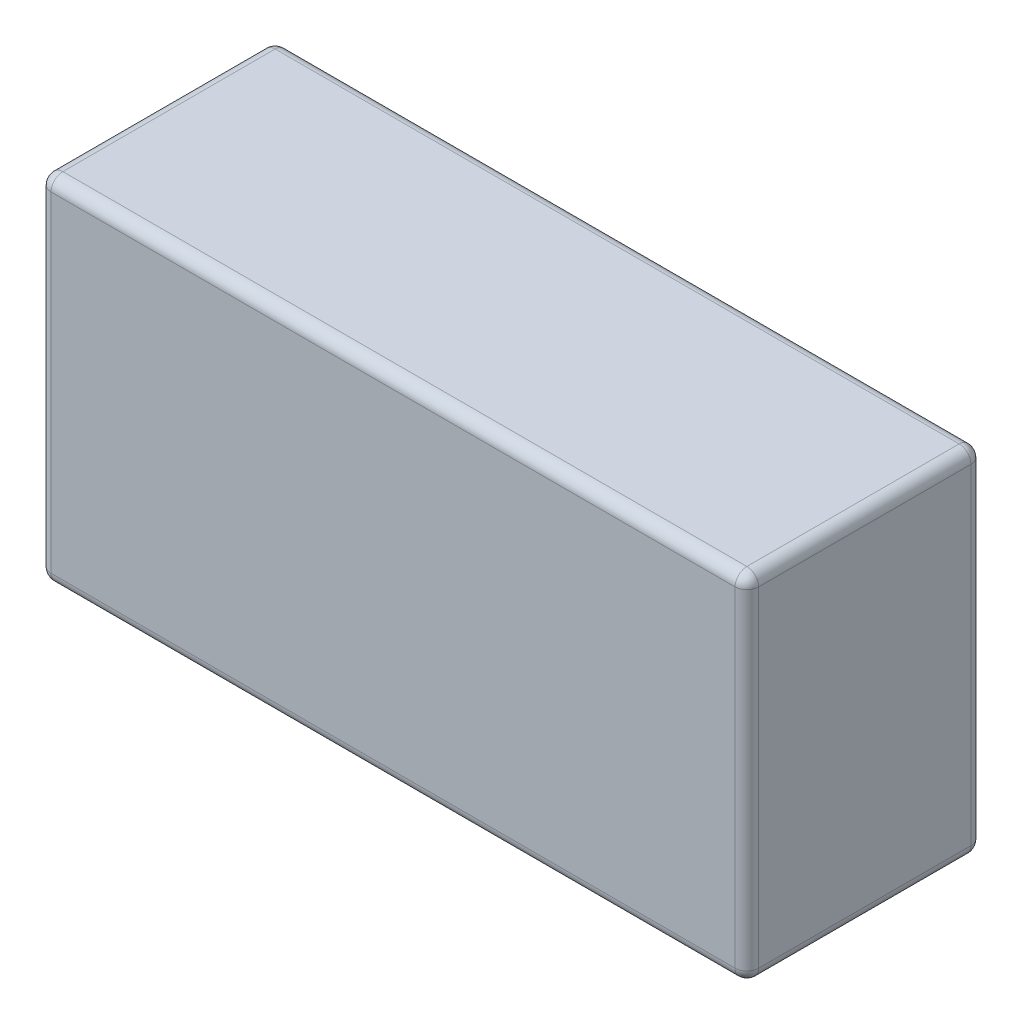
ISO-10303-21;
HEADER;
FILE_DESCRIPTION(('STEP AP214'),'2;1');
FILE_NAME('part.step','',(''),(''),'','','');
FILE_SCHEMA(('AUTOMOTIVE_DESIGN { 1 0 10303 214 1 1 1 1 }'));
ENDSEC;
DATA;
#1=APPLICATION_CONTEXT('core data for automotive mechanical design processes');
#2=APPLICATION_PROTOCOL_DEFINITION('international standard','automotive_design',2000,#1);
#3=PRODUCT_CONTEXT('',#1,'mechanical');
#4=PRODUCT('Part','Part','',(#3));
#5=PRODUCT_RELATED_PRODUCT_CATEGORY('part','',(#4));
#6=PRODUCT_DEFINITION_FORMATION('','',#4);
#7=PRODUCT_DEFINITION_CONTEXT('part definition',#1,'design');
#8=PRODUCT_DEFINITION('design','',#6,#7);
#9=PRODUCT_DEFINITION_SHAPE('','',#8);
#10=(LENGTH_UNIT() NAMED_UNIT(*) SI_UNIT(.MILLI.,.METRE.));
#11=(NAMED_UNIT(*) PLANE_ANGLE_UNIT() SI_UNIT($,.RADIAN.));
#12=(NAMED_UNIT(*) SI_UNIT($,.STERADIAN.) SOLID_ANGLE_UNIT());
#13=UNCERTAINTY_MEASURE_WITH_UNIT(LENGTH_MEASURE(1.E-05),#10,'distance_accuracy_value','');
#14=(GEOMETRIC_REPRESENTATION_CONTEXT(3) GLOBAL_UNCERTAINTY_ASSIGNED_CONTEXT((#13)) GLOBAL_UNIT_ASSIGNED_CONTEXT((#10,
#11,#12)) REPRESENTATION_CONTEXT('',''));
#15=CARTESIAN_POINT('',(0.,0.,0.));
#16=DIRECTION('',(0.,0.,1.));
#17=DIRECTION('',(1.,0.,0.));
#18=AXIS2_PLACEMENT_3D('',#15,#16,#17);
#19=CARTESIAN_POINT('',(30.,15.,20.));
#20=DIRECTION('',(-1.,0.,0.));
#21=DIRECTION('',(0.,-1.,0.));
#22=AXIS2_PLACEMENT_3D('',#19,#20,#21);
#23=PLANE('',#22);
#24=DIRECTION('',(0.,1.,0.));
#25=VECTOR('',#24,1.);
#26=CARTESIAN_POINT('',(30.,-15.,19.));
#27=LINE('',#26,#25);
#28=CARTESIAN_POINT('',(30.,14.,19.));
#29=VERTEX_POINT('',#28);
#30=CARTESIAN_POINT('',(30.,-14.,19.));
#31=VERTEX_POINT('',#30);
#32=EDGE_CURVE('E222',#29,#31,#27,.F.);
#33=ORIENTED_EDGE('',*,*,#32,.T.);
#34=DIRECTION('',(0.,0.,-1.));
#35=VECTOR('',#34,1.);
#36=CARTESIAN_POINT('',(30.,-14.,20.));
#37=LINE('',#36,#35);
#38=CARTESIAN_POINT('',(30.,-14.,1.));
#39=VERTEX_POINT('',#38);
#40=EDGE_CURVE('E226',#31,#39,#37,.T.);
#41=ORIENTED_EDGE('',*,*,#40,.T.);
#42=DIRECTION('',(0.,1.,0.));
#43=VECTOR('',#42,1.);
#44=CARTESIAN_POINT('',(30.,15.,1.));
#45=LINE('',#44,#43);
#46=CARTESIAN_POINT('',(30.,14.,1.));
#47=VERTEX_POINT('',#46);
#48=EDGE_CURVE('E219',#39,#47,#45,.T.);
#49=ORIENTED_EDGE('',*,*,#48,.T.);
#50=DIRECTION('',(0.,0.,-1.));
#51=VECTOR('',#50,1.);
#52=CARTESIAN_POINT('',(30.,14.,20.));
#53=LINE('',#52,#51);
#54=EDGE_CURVE('E216',#47,#29,#53,.F.);
#55=ORIENTED_EDGE('',*,*,#54,.T.);
#56=EDGE_LOOP('',(#33,#41,#49,#55));
#57=FACE_BOUND('',#56,.T.);
#58=ADVANCED_FACE('F43',(#57),#23,.F.);
#59=CARTESIAN_POINT('',(-30.,15.,20.));
#60=DIRECTION('',(0.,-1.,0.));
#61=DIRECTION('',(0.,0.,-1.));
#62=AXIS2_PLACEMENT_3D('',#59,#60,#61);
#63=PLANE('',#62);
#64=DIRECTION('',(-1.,0.,0.));
#65=VECTOR('',#64,1.);
#66=CARTESIAN_POINT('',(-30.,15.,1.));
#67=LINE('',#66,#65);
#68=CARTESIAN_POINT('',(29.,15.,1.));
#69=VERTEX_POINT('',#68);
#70=CARTESIAN_POINT('',(-29.,15.,1.));
#71=VERTEX_POINT('',#70);
#72=EDGE_CURVE('E53',#69,#71,#67,.T.);
#73=ORIENTED_EDGE('',*,*,#72,.T.);
#74=DIRECTION('',(0.,0.,-1.));
#75=VECTOR('',#74,1.);
#76=CARTESIAN_POINT('',(-29.,15.,20.));
#77=LINE('',#76,#75);
#78=CARTESIAN_POINT('',(-29.,15.,19.));
#79=VERTEX_POINT('',#78);
#80=EDGE_CURVE('E11',#71,#79,#77,.F.);
#81=ORIENTED_EDGE('',*,*,#80,.T.);
#82=DIRECTION('',(-1.,0.,0.));
#83=VECTOR('',#82,1.);
#84=CARTESIAN_POINT('',(30.,15.,19.));
#85=LINE('',#84,#83);
#86=CARTESIAN_POINT('',(29.,15.,19.));
#87=VERTEX_POINT('',#86);
#88=EDGE_CURVE('E232',#79,#87,#85,.F.);
#89=ORIENTED_EDGE('',*,*,#88,.T.);
#90=DIRECTION('',(0.,0.,-1.));
#91=VECTOR('',#90,1.);
#92=CARTESIAN_POINT('',(29.,15.,20.));
#93=LINE('',#92,#91);
#94=EDGE_CURVE('E229',#87,#69,#93,.T.);
#95=ORIENTED_EDGE('',*,*,#94,.T.);
#96=EDGE_LOOP('',(#73,#81,#89,#95));
#97=FACE_BOUND('',#96,.T.);
#98=ADVANCED_FACE('F353',(#97),#63,.F.);
#99=CARTESIAN_POINT('',(-30.,15.,20.));
#100=DIRECTION('',(1.,0.,0.));
#101=DIRECTION('',(0.,1.,0.));
#102=AXIS2_PLACEMENT_3D('',#99,#100,#101);
#103=PLANE('',#102);
#104=DIRECTION('',(0.,0.,-1.));
#105=VECTOR('',#104,1.);
#106=CARTESIAN_POINT('',(-30.,14.,20.));
#107=LINE('',#106,#105);
#108=CARTESIAN_POINT('',(-30.,14.,19.));
#109=VERTEX_POINT('',#108);
#110=CARTESIAN_POINT('',(-30.,14.,1.));
#111=VERTEX_POINT('',#110);
#112=EDGE_CURVE('E190',#109,#111,#107,.T.);
#113=ORIENTED_EDGE('',*,*,#112,.T.);
#114=DIRECTION('',(0.,-1.,0.));
#115=VECTOR('',#114,1.);
#116=CARTESIAN_POINT('',(-30.,15.,1.));
#117=LINE('',#116,#115);
#118=CARTESIAN_POINT('',(-30.,-14.,1.));
#119=VERTEX_POINT('',#118);
#120=EDGE_CURVE('E199',#111,#119,#117,.T.);
#121=ORIENTED_EDGE('',*,*,#120,.T.);
#122=DIRECTION('',(0.,0.,-1.));
#123=VECTOR('',#122,1.);
#124=CARTESIAN_POINT('',(-30.,-14.,20.));
#125=LINE('',#124,#123);
#126=CARTESIAN_POINT('',(-30.,-14.,19.));
#127=VERTEX_POINT('',#126);
#128=EDGE_CURVE('E196',#119,#127,#125,.F.);
#129=ORIENTED_EDGE('',*,*,#128,.T.);
#130=DIRECTION('',(0.,-1.,0.));
#131=VECTOR('',#130,1.);
#132=CARTESIAN_POINT('',(-30.,15.,19.));
#133=LINE('',#132,#131);
#134=EDGE_CURVE('E193',#127,#109,#133,.F.);
#135=ORIENTED_EDGE('',*,*,#134,.T.);
#136=EDGE_LOOP('',(#113,#121,#129,#135));
#137=FACE_BOUND('',#136,.T.);
#138=ADVANCED_FACE('F325',(#137),#103,.F.);
#139=CARTESIAN_POINT('',(-30.,-15.,20.));
#140=DIRECTION('',(0.,1.,0.));
#141=DIRECTION('',(0.,0.,1.));
#142=AXIS2_PLACEMENT_3D('',#139,#140,#141);
#143=PLANE('',#142);
#144=DIRECTION('',(0.,0.,-1.));
#145=VECTOR('',#144,1.);
#146=CARTESIAN_POINT('',(-29.,-15.,20.));
#147=LINE('',#146,#145);
#148=CARTESIAN_POINT('',(-29.,-15.,19.));
#149=VERTEX_POINT('',#148);
#150=CARTESIAN_POINT('',(-29.,-15.,1.));
#151=VERTEX_POINT('',#150);
#152=EDGE_CURVE('E171',#149,#151,#147,.T.);
#153=ORIENTED_EDGE('',*,*,#152,.T.);
#154=DIRECTION('',(1.,0.,0.));
#155=VECTOR('',#154,1.);
#156=CARTESIAN_POINT('',(-30.,-15.,1.));
#157=LINE('',#156,#155);
#158=CARTESIAN_POINT('',(29.,-15.,1.));
#159=VERTEX_POINT('',#158);
#160=EDGE_CURVE('E141',#151,#159,#157,.T.);
#161=ORIENTED_EDGE('',*,*,#160,.T.);
#162=DIRECTION('',(0.,0.,-1.));
#163=VECTOR('',#162,1.);
#164=CARTESIAN_POINT('',(29.,-15.,20.));
#165=LINE('',#164,#163);
#166=CARTESIAN_POINT('',(29.,-15.,19.));
#167=VERTEX_POINT('',#166);
#168=EDGE_CURVE('E160',#159,#167,#165,.F.);
#169=ORIENTED_EDGE('',*,*,#168,.T.);
#170=DIRECTION('',(1.,0.,0.));
#171=VECTOR('',#170,1.);
#172=CARTESIAN_POINT('',(-30.,-15.,19.));
#173=LINE('',#172,#171);
#174=EDGE_CURVE('E167',#167,#149,#173,.F.);
#175=ORIENTED_EDGE('',*,*,#174,.T.);
#176=EDGE_LOOP('',(#153,#161,#169,#175));
#177=FACE_BOUND('',#176,.T.);
#178=ADVANCED_FACE('F169',(#177),#143,.F.);
#179=CARTESIAN_POINT('',(0.,0.,20.));
#180=DIRECTION('',(0.,0.,1.));
#181=DIRECTION('',(1.,0.,0.));
#182=AXIS2_PLACEMENT_3D('',#179,#180,#181);
#183=PLANE('',#182);
#184=DIRECTION('',(0.,-1.,0.));
#185=VECTOR('',#184,1.);
#186=CARTESIAN_POINT('',(-29.,-15.,20.));
#187=LINE('',#186,#185);
#188=CARTESIAN_POINT('',(-29.,14.,20.));
#189=VERTEX_POINT('',#188);
#190=CARTESIAN_POINT('',(-29.,-14.,20.));
#191=VERTEX_POINT('',#190);
#192=EDGE_CURVE('E206',#189,#191,#187,.T.);
#193=ORIENTED_EDGE('',*,*,#192,.T.);
#194=DIRECTION('',(1.,0.,0.));
#195=VECTOR('',#194,1.);
#196=CARTESIAN_POINT('',(30.,-14.,20.));
#197=LINE('',#196,#195);
#198=CARTESIAN_POINT('',(29.,-14.,20.));
#199=VERTEX_POINT('',#198);
#200=EDGE_CURVE('E212',#191,#199,#197,.T.);
#201=ORIENTED_EDGE('',*,*,#200,.T.);
#202=DIRECTION('',(0.,1.,0.));
#203=VECTOR('',#202,1.);
#204=CARTESIAN_POINT('',(29.,15.,20.));
#205=LINE('',#204,#203);
#206=CARTESIAN_POINT('',(29.,14.,20.));
#207=VERTEX_POINT('',#206);
#208=EDGE_CURVE('E209',#199,#207,#205,.T.);
#209=ORIENTED_EDGE('',*,*,#208,.T.);
#210=DIRECTION('',(-1.,0.,0.));
#211=VECTOR('',#210,1.);
#212=CARTESIAN_POINT('',(-30.,14.,20.));
#213=LINE('',#212,#211);
#214=EDGE_CURVE('E203',#207,#189,#213,.T.);
#215=ORIENTED_EDGE('',*,*,#214,.T.);
#216=EDGE_LOOP('',(#193,#201,#209,#215));
#217=FACE_BOUND('',#216,.T.);
#218=ADVANCED_FACE('F334',(#217),#183,.T.);
#219=CARTESIAN_POINT('',(0.,0.,0.));
#220=DIRECTION('',(0.,0.,1.));
#221=DIRECTION('',(1.,0.,0.));
#222=AXIS2_PLACEMENT_3D('',#219,#220,#221);
#223=PLANE('',#222);
#224=DIRECTION('',(0.,1.,0.));
#225=VECTOR('',#224,1.);
#226=CARTESIAN_POINT('',(29.,0.,0.));
#227=LINE('',#226,#225);
#228=CARTESIAN_POINT('',(29.,14.,0.));
#229=VERTEX_POINT('',#228);
#230=CARTESIAN_POINT('',(29.,-14.,0.));
#231=VERTEX_POINT('',#230);
#232=EDGE_CURVE('E178',#229,#231,#227,.F.);
#233=ORIENTED_EDGE('',*,*,#232,.T.);
#234=DIRECTION('',(1.,0.,0.));
#235=VECTOR('',#234,1.);
#236=CARTESIAN_POINT('',(0.,-14.,0.));
#237=LINE('',#236,#235);
#238=CARTESIAN_POINT('',(-29.,-14.,0.));
#239=VERTEX_POINT('',#238);
#240=EDGE_CURVE('E143',#231,#239,#237,.F.);
#241=ORIENTED_EDGE('',*,*,#240,.T.);
#242=DIRECTION('',(0.,-1.,0.));
#243=VECTOR('',#242,1.);
#244=CARTESIAN_POINT('',(-29.,0.,0.));
#245=LINE('',#244,#243);
#246=CARTESIAN_POINT('',(-29.,14.,0.));
#247=VERTEX_POINT('',#246);
#248=EDGE_CURVE('E185',#239,#247,#245,.F.);
#249=ORIENTED_EDGE('',*,*,#248,.T.);
#250=DIRECTION('',(-1.,0.,0.));
#251=VECTOR('',#250,1.);
#252=CARTESIAN_POINT('',(0.,14.,0.));
#253=LINE('',#252,#251);
#254=EDGE_CURVE('E174',#247,#229,#253,.F.);
#255=ORIENTED_EDGE('',*,*,#254,.T.);
#256=EDGE_LOOP('',(#233,#241,#249,#255));
#257=FACE_BOUND('',#256,.T.);
#258=ADVANCED_FACE('F413',(#257),#223,.F.);
#259=CARTESIAN_POINT('',(0.,14.,19.));
#260=DIRECTION('',(1.,0.,0.));
#261=DIRECTION('',(0.,0.,-1.));
#262=AXIS2_PLACEMENT_3D('',#259,#260,#261);
#263=CYLINDRICAL_SURFACE('',#262,1.);
#264=CARTESIAN_POINT('',(-29.,14.,19.));
#265=DIRECTION('',(-1.,0.,0.));
#266=DIRECTION('',(0.,0.,1.));
#267=AXIS2_PLACEMENT_3D('',#264,#265,#266);
#268=CIRCLE('',#267,1.);
#269=EDGE_CURVE('E47',#189,#79,#268,.T.);
#270=ORIENTED_EDGE('',*,*,#269,.F.);
#271=ORIENTED_EDGE('',*,*,#214,.F.);
#272=CARTESIAN_POINT('',(29.,14.,19.));
#273=DIRECTION('',(1.,0.,0.));
#274=DIRECTION('',(0.,0.,-1.));
#275=AXIS2_PLACEMENT_3D('',#272,#273,#274);
#276=CIRCLE('',#275,1.);
#277=EDGE_CURVE('E304',#87,#207,#276,.T.);
#278=ORIENTED_EDGE('',*,*,#277,.F.);
#279=ORIENTED_EDGE('',*,*,#88,.F.);
#280=EDGE_LOOP('',(#270,#271,#278,#279));
#281=FACE_BOUND('',#280,.T.);
#282=ADVANCED_FACE('F45',(#281),#263,.T.);
#283=CARTESIAN_POINT('',(-29.,14.,19.));
#284=DIRECTION('',(0.,1.,0.));
#285=DIRECTION('',(0.,0.,1.));
#286=AXIS2_PLACEMENT_3D('',#283,#284,#285);
#287=SPHERICAL_SURFACE('',#286,1.);
#288=CARTESIAN_POINT('',(-29.,14.,19.));
#289=DIRECTION('',(0.,1.,0.));
#290=DIRECTION('',(0.,0.,1.));
#291=AXIS2_PLACEMENT_3D('',#288,#289,#290);
#292=CIRCLE('',#291,1.);
#293=EDGE_CURVE('E297',#189,#109,#292,.F.);
#294=ORIENTED_EDGE('',*,*,#293,.F.);
#295=ORIENTED_EDGE('',*,*,#269,.T.);
#296=CARTESIAN_POINT('',(-29.,14.,19.));
#297=DIRECTION('',(0.,0.,1.));
#298=DIRECTION('',(1.,0.,0.));
#299=AXIS2_PLACEMENT_3D('',#296,#297,#298);
#300=CIRCLE('',#299,1.);
#301=EDGE_CURVE('E301',#109,#79,#300,.F.);
#302=ORIENTED_EDGE('',*,*,#301,.F.);
#303=EDGE_LOOP('',(#294,#295,#302));
#304=FACE_BOUND('',#303,.T.);
#305=ADVANCED_FACE('F317',(#304),#287,.T.);
#306=CARTESIAN_POINT('',(29.,14.,19.));
#307=DIRECTION('',(0.,0.,1.));
#308=DIRECTION('',(1.,0.,0.));
#309=AXIS2_PLACEMENT_3D('',#306,#307,#308);
#310=SPHERICAL_SURFACE('',#309,1.);
#311=CARTESIAN_POINT('',(29.,14.,19.));
#312=DIRECTION('',(0.,0.,1.));
#313=DIRECTION('',(1.,0.,0.));
#314=AXIS2_PLACEMENT_3D('',#311,#312,#313);
#315=CIRCLE('',#314,1.);
#316=EDGE_CURVE('E289',#87,#29,#315,.F.);
#317=ORIENTED_EDGE('',*,*,#316,.F.);
#318=ORIENTED_EDGE('',*,*,#277,.T.);
#319=CARTESIAN_POINT('',(29.,14.,19.));
#320=DIRECTION('',(0.,1.,0.));
#321=DIRECTION('',(0.,0.,1.));
#322=AXIS2_PLACEMENT_3D('',#319,#320,#321);
#323=CIRCLE('',#322,1.);
#324=EDGE_CURVE('E293',#29,#207,#323,.F.);
#325=ORIENTED_EDGE('',*,*,#324,.F.);
#326=EDGE_LOOP('',(#317,#318,#325));
#327=FACE_BOUND('',#326,.T.);
#328=ADVANCED_FACE('F347',(#327),#310,.T.);
#329=CARTESIAN_POINT('',(-29.,14.,20.));
#330=DIRECTION('',(0.,0.,-1.));
#331=DIRECTION('',(-1.,0.,0.));
#332=AXIS2_PLACEMENT_3D('',#329,#330,#331);
#333=CYLINDRICAL_SURFACE('',#332,1.);
#334=ORIENTED_EDGE('',*,*,#301,.T.);
#335=ORIENTED_EDGE('',*,*,#80,.F.);
#336=CARTESIAN_POINT('',(-29.,14.,1.));
#337=DIRECTION('',(0.,0.,-1.));
#338=DIRECTION('',(-1.,0.,0.));
#339=AXIS2_PLACEMENT_3D('',#336,#337,#338);
#340=CIRCLE('',#339,1.);
#341=EDGE_CURVE('E61',#111,#71,#340,.T.);
#342=ORIENTED_EDGE('',*,*,#341,.F.);
#343=ORIENTED_EDGE('',*,*,#112,.F.);
#344=EDGE_LOOP('',(#334,#335,#342,#343));
#345=FACE_BOUND('',#344,.T.);
#346=ADVANCED_FACE('F323',(#345),#333,.T.);
#347=CARTESIAN_POINT('',(-29.,0.,19.));
#348=DIRECTION('',(0.,1.,0.));
#349=DIRECTION('',(-1.,0.,0.));
#350=AXIS2_PLACEMENT_3D('',#347,#348,#349);
#351=CYLINDRICAL_SURFACE('',#350,1.);
#352=ORIENTED_EDGE('',*,*,#293,.T.);
#353=ORIENTED_EDGE('',*,*,#134,.F.);
#354=CARTESIAN_POINT('',(-29.,-14.,19.));
#355=DIRECTION('',(0.,-1.,0.));
#356=DIRECTION('',(0.,0.,-1.));
#357=AXIS2_PLACEMENT_3D('',#354,#355,#356);
#358=CIRCLE('',#357,1.);
#359=EDGE_CURVE('E280',#191,#127,#358,.T.);
#360=ORIENTED_EDGE('',*,*,#359,.F.);
#361=ORIENTED_EDGE('',*,*,#192,.F.);
#362=EDGE_LOOP('',(#352,#353,#360,#361));
#363=FACE_BOUND('',#362,.T.);
#364=ADVANCED_FACE('F331',(#363),#351,.T.);
#365=CARTESIAN_POINT('',(0.,-14.,19.));
#366=DIRECTION('',(-1.,0.,0.));
#367=DIRECTION('',(0.,0.,1.));
#368=AXIS2_PLACEMENT_3D('',#365,#366,#367);
#369=CYLINDRICAL_SURFACE('',#368,1.);
#370=CARTESIAN_POINT('',(29.,-14.,19.));
#371=DIRECTION('',(1.,0.,0.));
#372=DIRECTION('',(0.,0.,-1.));
#373=AXIS2_PLACEMENT_3D('',#370,#371,#372);
#374=CIRCLE('',#373,1.);
#375=EDGE_CURVE('E272',#199,#167,#374,.T.);
#376=ORIENTED_EDGE('',*,*,#375,.F.);
#377=ORIENTED_EDGE('',*,*,#200,.F.);
#378=CARTESIAN_POINT('',(-29.,-14.,19.));
#379=DIRECTION('',(-1.,0.,0.));
#380=DIRECTION('',(0.,0.,1.));
#381=AXIS2_PLACEMENT_3D('',#378,#379,#380);
#382=CIRCLE('',#381,1.);
#383=EDGE_CURVE('E276',#149,#191,#382,.T.);
#384=ORIENTED_EDGE('',*,*,#383,.F.);
#385=ORIENTED_EDGE('',*,*,#174,.F.);
#386=EDGE_LOOP('',(#376,#377,#384,#385));
#387=FACE_BOUND('',#386,.T.);
#388=ADVANCED_FACE('F338',(#387),#369,.T.);
#389=CARTESIAN_POINT('',(29.,0.,19.));
#390=DIRECTION('',(0.,-1.,0.));
#391=DIRECTION('',(1.,0.,0.));
#392=AXIS2_PLACEMENT_3D('',#389,#390,#391);
#393=CYLINDRICAL_SURFACE('',#392,1.);
#394=ORIENTED_EDGE('',*,*,#324,.T.);
#395=ORIENTED_EDGE('',*,*,#208,.F.);
#396=CARTESIAN_POINT('',(29.,-14.,19.));
#397=DIRECTION('',(0.,-1.,0.));
#398=DIRECTION('',(0.,0.,-1.));
#399=AXIS2_PLACEMENT_3D('',#396,#397,#398);
#400=CIRCLE('',#399,1.);
#401=EDGE_CURVE('E269',#31,#199,#400,.T.);
#402=ORIENTED_EDGE('',*,*,#401,.F.);
#403=ORIENTED_EDGE('',*,*,#32,.F.);
#404=EDGE_LOOP('',(#394,#395,#402,#403));
#405=FACE_BOUND('',#404,.T.);
#406=ADVANCED_FACE('F344',(#405),#393,.T.);
#407=CARTESIAN_POINT('',(29.,14.,20.));
#408=DIRECTION('',(0.,0.,-1.));
#409=DIRECTION('',(-1.,0.,0.));
#410=AXIS2_PLACEMENT_3D('',#407,#408,#409);
#411=CYLINDRICAL_SURFACE('',#410,1.);
#412=ORIENTED_EDGE('',*,*,#316,.T.);
#413=ORIENTED_EDGE('',*,*,#54,.F.);
#414=CARTESIAN_POINT('',(29.,14.,1.));
#415=DIRECTION('',(0.,0.,-1.));
#416=DIRECTION('',(-1.,0.,0.));
#417=AXIS2_PLACEMENT_3D('',#414,#415,#416);
#418=CIRCLE('',#417,1.);
#419=EDGE_CURVE('E265',#69,#47,#418,.T.);
#420=ORIENTED_EDGE('',*,*,#419,.F.);
#421=ORIENTED_EDGE('',*,*,#94,.F.);
#422=EDGE_LOOP('',(#412,#413,#420,#421));
#423=FACE_BOUND('',#422,.T.);
#424=ADVANCED_FACE('F351',(#423),#411,.T.);
#425=CARTESIAN_POINT('',(-30.,14.,1.));
#426=DIRECTION('',(-1.,0.,0.));
#427=DIRECTION('',(0.,0.,1.));
#428=AXIS2_PLACEMENT_3D('',#425,#426,#427);
#429=CYLINDRICAL_SURFACE('',#428,1.);
#430=CARTESIAN_POINT('',(-29.,14.,1.));
#431=DIRECTION('',(-1.,0.,0.));
#432=DIRECTION('',(0.,0.,1.));
#433=AXIS2_PLACEMENT_3D('',#430,#431,#432);
#434=CIRCLE('',#433,1.);
#435=EDGE_CURVE('E286',#71,#247,#434,.T.);
#436=ORIENTED_EDGE('',*,*,#435,.F.);
#437=ORIENTED_EDGE('',*,*,#72,.F.);
#438=CARTESIAN_POINT('',(29.,14.,1.));
#439=DIRECTION('',(1.,0.,0.));
#440=DIRECTION('',(0.,0.,-1.));
#441=AXIS2_PLACEMENT_3D('',#438,#439,#440);
#442=CIRCLE('',#441,1.);
#443=EDGE_CURVE('E261',#229,#69,#442,.T.);
#444=ORIENTED_EDGE('',*,*,#443,.F.);
#445=ORIENTED_EDGE('',*,*,#254,.F.);
#446=EDGE_LOOP('',(#436,#437,#444,#445));
#447=FACE_BOUND('',#446,.T.);
#448=ADVANCED_FACE('F356',(#447),#429,.T.);
#449=CARTESIAN_POINT('',(-29.,14.,1.));
#450=DIRECTION('',(0.,1.,0.));
#451=DIRECTION('',(0.,0.,1.));
#452=AXIS2_PLACEMENT_3D('',#449,#450,#451);
#453=SPHERICAL_SURFACE('',#452,1.);
#454=ORIENTED_EDGE('',*,*,#341,.T.);
#455=ORIENTED_EDGE('',*,*,#435,.T.);
#456=CARTESIAN_POINT('',(-29.,14.,1.));
#457=DIRECTION('',(0.,1.,0.));
#458=DIRECTION('',(0.,0.,1.));
#459=AXIS2_PLACEMENT_3D('',#456,#457,#458);
#460=CIRCLE('',#459,1.);
#461=EDGE_CURVE('E257',#111,#247,#460,.F.);
#462=ORIENTED_EDGE('',*,*,#461,.F.);
#463=EDGE_LOOP('',(#454,#455,#462));
#464=FACE_BOUND('',#463,.T.);
#465=ADVANCED_FACE('F359',(#464),#453,.T.);
#466=CARTESIAN_POINT('',(-29.,-14.,19.));
#467=DIRECTION('',(0.,0.,1.));
#468=DIRECTION('',(1.,0.,0.));
#469=AXIS2_PLACEMENT_3D('',#466,#467,#468);
#470=SPHERICAL_SURFACE('',#469,1.);
#471=ORIENTED_EDGE('',*,*,#383,.T.);
#472=ORIENTED_EDGE('',*,*,#359,.T.);
#473=CARTESIAN_POINT('',(-29.,-14.,19.));
#474=DIRECTION('',(0.,0.,1.));
#475=DIRECTION('',(1.,0.,0.));
#476=AXIS2_PLACEMENT_3D('',#473,#474,#475);
#477=CIRCLE('',#476,1.);
#478=EDGE_CURVE('E253',#149,#127,#477,.F.);
#479=ORIENTED_EDGE('',*,*,#478,.F.);
#480=EDGE_LOOP('',(#471,#472,#479));
#481=FACE_BOUND('',#480,.T.);
#482=ADVANCED_FACE('F369',(#481),#470,.T.);
#483=CARTESIAN_POINT('',(29.,-14.,19.));
#484=DIRECTION('',(0.,0.,1.));
#485=DIRECTION('',(1.,0.,0.));
#486=AXIS2_PLACEMENT_3D('',#483,#484,#485);
#487=SPHERICAL_SURFACE('',#486,1.);
#488=ORIENTED_EDGE('',*,*,#401,.T.);
#489=ORIENTED_EDGE('',*,*,#375,.T.);
#490=CARTESIAN_POINT('',(29.,-14.,19.));
#491=DIRECTION('',(0.,0.,1.));
#492=DIRECTION('',(1.,0.,0.));
#493=AXIS2_PLACEMENT_3D('',#490,#491,#492);
#494=CIRCLE('',#493,1.);
#495=EDGE_CURVE('E163',#31,#167,#494,.F.);
#496=ORIENTED_EDGE('',*,*,#495,.F.);
#497=EDGE_LOOP('',(#488,#489,#496));
#498=FACE_BOUND('',#497,.T.);
#499=ADVANCED_FACE('F371',(#498),#487,.T.);
#500=CARTESIAN_POINT('',(29.,14.,1.));
#501=DIRECTION('',(0.,1.,0.));
#502=DIRECTION('',(0.,0.,1.));
#503=AXIS2_PLACEMENT_3D('',#500,#501,#502);
#504=SPHERICAL_SURFACE('',#503,1.);
#505=ORIENTED_EDGE('',*,*,#443,.T.);
#506=ORIENTED_EDGE('',*,*,#419,.T.);
#507=CARTESIAN_POINT('',(29.,14.,1.));
#508=DIRECTION('',(0.,1.,0.));
#509=DIRECTION('',(0.,0.,1.));
#510=AXIS2_PLACEMENT_3D('',#507,#508,#509);
#511=CIRCLE('',#510,1.);
#512=EDGE_CURVE('E247',#229,#47,#511,.F.);
#513=ORIENTED_EDGE('',*,*,#512,.F.);
#514=EDGE_LOOP('',(#505,#506,#513));
#515=FACE_BOUND('',#514,.T.);
#516=ADVANCED_FACE('F377',(#515),#504,.T.);
#517=CARTESIAN_POINT('',(-29.,15.,1.));
#518=DIRECTION('',(0.,-1.,0.));
#519=DIRECTION('',(1.,0.,0.));
#520=AXIS2_PLACEMENT_3D('',#517,#518,#519);
#521=CYLINDRICAL_SURFACE('',#520,1.);
#522=ORIENTED_EDGE('',*,*,#461,.T.);
#523=ORIENTED_EDGE('',*,*,#248,.F.);
#524=CARTESIAN_POINT('',(-29.,-14.,1.));
#525=DIRECTION('',(0.,-1.,0.));
#526=DIRECTION('',(0.,0.,-1.));
#527=AXIS2_PLACEMENT_3D('',#524,#525,#526);
#528=CIRCLE('',#527,1.);
#529=EDGE_CURVE('E243',#119,#239,#528,.T.);
#530=ORIENTED_EDGE('',*,*,#529,.F.);
#531=ORIENTED_EDGE('',*,*,#120,.F.);
#532=EDGE_LOOP('',(#522,#523,#530,#531));
#533=FACE_BOUND('',#532,.T.);
#534=ADVANCED_FACE('F362',(#533),#521,.T.);
#535=CARTESIAN_POINT('',(-29.,-14.,20.));
#536=DIRECTION('',(0.,0.,-1.));
#537=DIRECTION('',(-1.,0.,0.));
#538=AXIS2_PLACEMENT_3D('',#535,#536,#537);
#539=CYLINDRICAL_SURFACE('',#538,1.);
#540=ORIENTED_EDGE('',*,*,#478,.T.);
#541=ORIENTED_EDGE('',*,*,#128,.F.);
#542=CARTESIAN_POINT('',(-29.,-14.,1.));
#543=DIRECTION('',(0.,0.,-1.));
#544=DIRECTION('',(-1.,0.,0.));
#545=AXIS2_PLACEMENT_3D('',#542,#543,#544);
#546=CIRCLE('',#545,1.);
#547=EDGE_CURVE('E157',#151,#119,#546,.T.);
#548=ORIENTED_EDGE('',*,*,#547,.F.);
#549=ORIENTED_EDGE('',*,*,#152,.F.);
#550=EDGE_LOOP('',(#540,#541,#548,#549));
#551=FACE_BOUND('',#550,.T.);
#552=ADVANCED_FACE('F367',(#551),#539,.T.);
#553=CARTESIAN_POINT('',(29.,-14.,20.));
#554=DIRECTION('',(0.,0.,-1.));
#555=DIRECTION('',(-1.,0.,0.));
#556=AXIS2_PLACEMENT_3D('',#553,#554,#555);
#557=CYLINDRICAL_SURFACE('',#556,1.);
#558=ORIENTED_EDGE('',*,*,#495,.T.);
#559=ORIENTED_EDGE('',*,*,#168,.F.);
#560=CARTESIAN_POINT('',(29.,-14.,1.));
#561=DIRECTION('',(0.,0.,-1.));
#562=DIRECTION('',(-1.,0.,0.));
#563=AXIS2_PLACEMENT_3D('',#560,#561,#562);
#564=CIRCLE('',#563,1.);
#565=EDGE_CURVE('E150',#39,#159,#564,.T.);
#566=ORIENTED_EDGE('',*,*,#565,.F.);
#567=ORIENTED_EDGE('',*,*,#40,.F.);
#568=EDGE_LOOP('',(#558,#559,#566,#567));
#569=FACE_BOUND('',#568,.T.);
#570=ADVANCED_FACE('F161',(#569),#557,.T.);
#571=CARTESIAN_POINT('',(29.,15.,1.));
#572=DIRECTION('',(0.,1.,0.));
#573=DIRECTION('',(-1.,0.,0.));
#574=AXIS2_PLACEMENT_3D('',#571,#572,#573);
#575=CYLINDRICAL_SURFACE('',#574,1.);
#576=ORIENTED_EDGE('',*,*,#512,.T.);
#577=ORIENTED_EDGE('',*,*,#48,.F.);
#578=CARTESIAN_POINT('',(29.,-14.,1.));
#579=DIRECTION('',(0.,-1.,0.));
#580=DIRECTION('',(1.,0.,0.));
#581=AXIS2_PLACEMENT_3D('',#578,#579,#580);
#582=CIRCLE('',#581,1.);
#583=EDGE_CURVE('E154',#231,#39,#582,.T.);
#584=ORIENTED_EDGE('',*,*,#583,.F.);
#585=ORIENTED_EDGE('',*,*,#232,.F.);
#586=EDGE_LOOP('',(#576,#577,#584,#585));
#587=FACE_BOUND('',#586,.T.);
#588=ADVANCED_FACE('F396',(#587),#575,.T.);
#589=CARTESIAN_POINT('',(-29.,-14.,1.));
#590=DIRECTION('',(-1.,0.,0.));
#591=DIRECTION('',(0.,0.,1.));
#592=AXIS2_PLACEMENT_3D('',#589,#590,#591);
#593=SPHERICAL_SURFACE('',#592,1.);
#594=ORIENTED_EDGE('',*,*,#547,.T.);
#595=ORIENTED_EDGE('',*,*,#529,.T.);
#596=CARTESIAN_POINT('',(-29.,-14.,1.));
#597=DIRECTION('',(-1.,0.,0.));
#598=DIRECTION('',(0.,0.,1.));
#599=AXIS2_PLACEMENT_3D('',#596,#597,#598);
#600=CIRCLE('',#599,1.);
#601=EDGE_CURVE('E147',#151,#239,#600,.F.);
#602=ORIENTED_EDGE('',*,*,#601,.F.);
#603=EDGE_LOOP('',(#594,#595,#602));
#604=FACE_BOUND('',#603,.T.);
#605=ADVANCED_FACE('F393',(#604),#593,.T.);
#606=CARTESIAN_POINT('',(29.,-14.,1.));
#607=DIRECTION('',(1.,0.,0.));
#608=DIRECTION('',(0.,1.,0.));
#609=AXIS2_PLACEMENT_3D('',#606,#607,#608);
#610=SPHERICAL_SURFACE('',#609,1.);
#611=ORIENTED_EDGE('',*,*,#583,.T.);
#612=ORIENTED_EDGE('',*,*,#565,.T.);
#613=CARTESIAN_POINT('',(29.,-14.,1.));
#614=DIRECTION('',(1.,0.,0.));
#615=DIRECTION('',(0.,0.,-1.));
#616=AXIS2_PLACEMENT_3D('',#613,#614,#615);
#617=CIRCLE('',#616,1.);
#618=EDGE_CURVE('E137',#231,#159,#617,.F.);
#619=ORIENTED_EDGE('',*,*,#618,.F.);
#620=EDGE_LOOP('',(#611,#612,#619));
#621=FACE_BOUND('',#620,.T.);
#622=ADVANCED_FACE('F152',(#621),#610,.T.);
#623=CARTESIAN_POINT('',(-30.,-14.,1.));
#624=DIRECTION('',(1.,0.,0.));
#625=DIRECTION('',(0.,0.,-1.));
#626=AXIS2_PLACEMENT_3D('',#623,#624,#625);
#627=CYLINDRICAL_SURFACE('',#626,1.);
#628=ORIENTED_EDGE('',*,*,#601,.T.);
#629=ORIENTED_EDGE('',*,*,#240,.F.);
#630=ORIENTED_EDGE('',*,*,#618,.T.);
#631=ORIENTED_EDGE('',*,*,#160,.F.);
#632=EDGE_LOOP('',(#628,#629,#630,#631));
#633=FACE_BOUND('',#632,.T.);
#634=ADVANCED_FACE('F139',(#633),#627,.T.);
#635=CLOSED_SHELL('',(#58,#98,#138,#178,#218,#258,#282,#305,#328,#346,#364,#388,#406,#424,#448,
#465,#482,#499,#516,#534,#552,#570,#588,#605,#622,#634));
#636=MANIFOLD_SOLID_BREP('B2',#635);
#637=ADVANCED_BREP_SHAPE_REPRESENTATION('',(#18,#636),#14);
#638=SHAPE_DEFINITION_REPRESENTATION(#9,#637);
ENDSEC;
END-ISO-10303-21;
